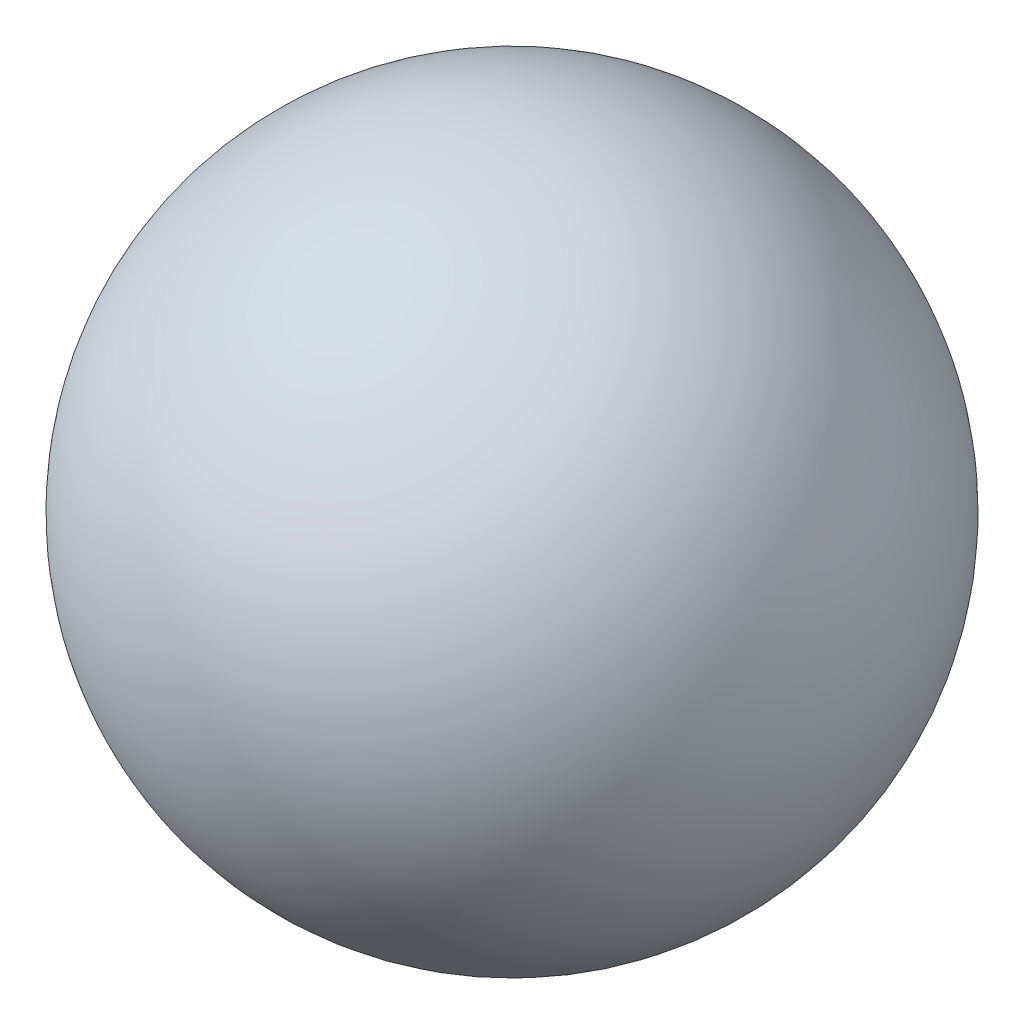
ISO-10303-21;
HEADER;
FILE_DESCRIPTION(('STEP AP214'),'2;1');
FILE_NAME('part.step','',(''),(''),'','','');
FILE_SCHEMA(('AUTOMOTIVE_DESIGN { 1 0 10303 214 1 1 1 1 }'));
ENDSEC;
DATA;
#1=APPLICATION_CONTEXT('core data for automotive mechanical design processes');
#2=APPLICATION_PROTOCOL_DEFINITION('international standard','automotive_design',2000,#1);
#3=PRODUCT_CONTEXT('',#1,'mechanical');
#4=PRODUCT('Part','Part','',(#3));
#5=PRODUCT_RELATED_PRODUCT_CATEGORY('part','',(#4));
#6=PRODUCT_DEFINITION_FORMATION('','',#4);
#7=PRODUCT_DEFINITION_CONTEXT('part definition',#1,'design');
#8=PRODUCT_DEFINITION('design','',#6,#7);
#9=PRODUCT_DEFINITION_SHAPE('','',#8);
#10=(LENGTH_UNIT() NAMED_UNIT(*) SI_UNIT(.MILLI.,.METRE.));
#11=(NAMED_UNIT(*) PLANE_ANGLE_UNIT() SI_UNIT($,.RADIAN.));
#12=(NAMED_UNIT(*) SI_UNIT($,.STERADIAN.) SOLID_ANGLE_UNIT());
#13=UNCERTAINTY_MEASURE_WITH_UNIT(LENGTH_MEASURE(1.E-05),#10,'distance_accuracy_value','');
#14=(GEOMETRIC_REPRESENTATION_CONTEXT(3) GLOBAL_UNCERTAINTY_ASSIGNED_CONTEXT((#13)) GLOBAL_UNIT_ASSIGNED_CONTEXT((#10,
#11,#12)) REPRESENTATION_CONTEXT('',''));
#15=CARTESIAN_POINT('',(0.,0.,0.));
#16=DIRECTION('',(0.,0.,1.));
#17=DIRECTION('',(1.,0.,0.));
#18=AXIS2_PLACEMENT_3D('',#15,#16,#17);
#19=CARTESIAN_POINT('',(-11.630401942101,-2.,-1.6721993497111));
#20=DIRECTION('',(0.,0.,1.));
#21=DIRECTION('',(1.,0.,0.));
#22=AXIS2_PLACEMENT_3D('',#19,#20,#21);
#23=SPHERICAL_SURFACE('',#22,1.05);
#24=CARTESIAN_POINT('',(-11.630401942101,-2.,-0.6221993497111));
#25=VERTEX_POINT('',#24);
#26=VERTEX_LOOP('',#25);
#27=FACE_BOUND('',#26,.T.);
#28=ADVANCED_FACE('F13',(#27),#23,.T.);
#29=CLOSED_SHELL('',(#28));
#30=MANIFOLD_SOLID_BREP('B1',#29);
#31=ADVANCED_BREP_SHAPE_REPRESENTATION('',(#18,#30),#14);
#32=SHAPE_DEFINITION_REPRESENTATION(#9,#31);
ENDSEC;
END-ISO-10303-21;
